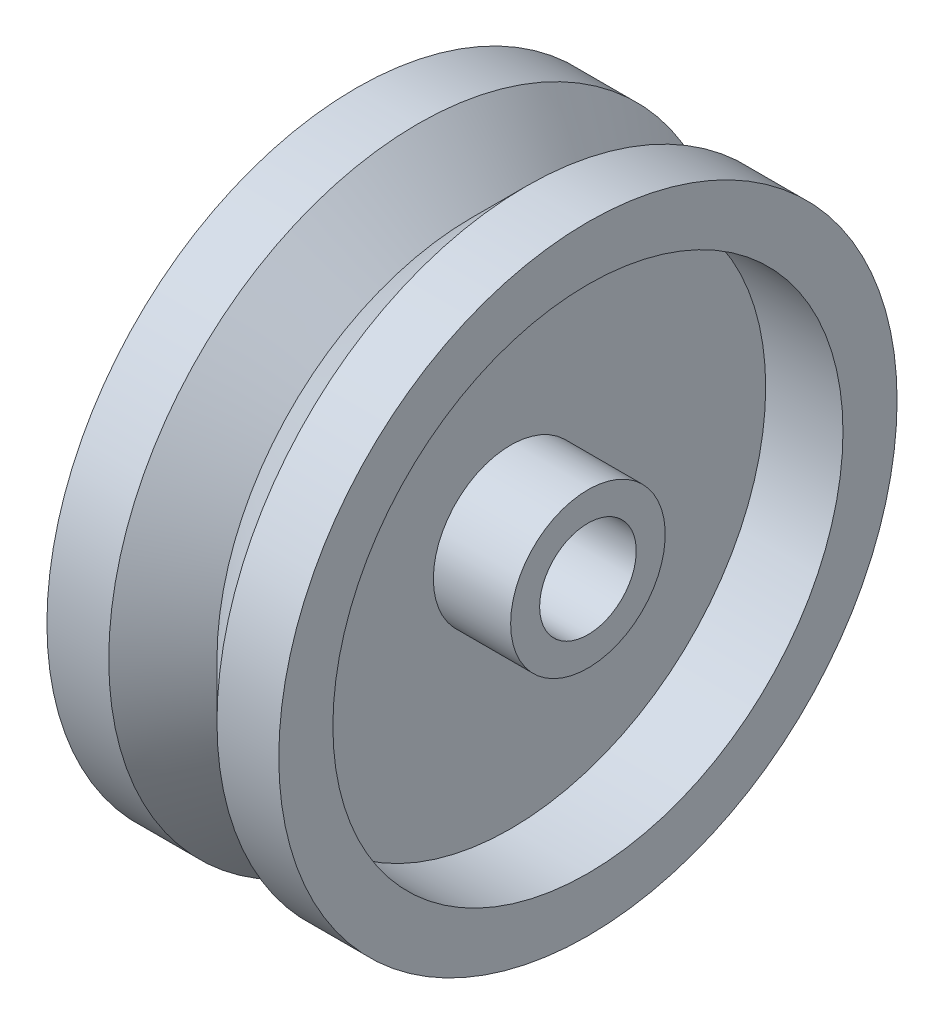
ISO-10303-21;
HEADER;
FILE_DESCRIPTION(('STEP AP214'),'2;1');
FILE_NAME('part.step','',(''),(''),'','','');
FILE_SCHEMA(('AUTOMOTIVE_DESIGN { 1 0 10303 214 1 1 1 1 }'));
ENDSEC;
DATA;
#1=APPLICATION_CONTEXT('core data for automotive mechanical design processes');
#2=APPLICATION_PROTOCOL_DEFINITION('international standard','automotive_design',2000,#1);
#3=PRODUCT_CONTEXT('',#1,'mechanical');
#4=PRODUCT('Part','Part','',(#3));
#5=PRODUCT_RELATED_PRODUCT_CATEGORY('part','',(#4));
#6=PRODUCT_DEFINITION_FORMATION('','',#4);
#7=PRODUCT_DEFINITION_CONTEXT('part definition',#1,'design');
#8=PRODUCT_DEFINITION('design','',#6,#7);
#9=PRODUCT_DEFINITION_SHAPE('','',#8);
#10=(LENGTH_UNIT() NAMED_UNIT(*) SI_UNIT(.MILLI.,.METRE.));
#11=(NAMED_UNIT(*) PLANE_ANGLE_UNIT() SI_UNIT($,.RADIAN.));
#12=(NAMED_UNIT(*) SI_UNIT($,.STERADIAN.) SOLID_ANGLE_UNIT());
#13=UNCERTAINTY_MEASURE_WITH_UNIT(LENGTH_MEASURE(1.E-05),#10,'distance_accuracy_value','');
#14=(GEOMETRIC_REPRESENTATION_CONTEXT(3) GLOBAL_UNCERTAINTY_ASSIGNED_CONTEXT((#13)) GLOBAL_UNIT_ASSIGNED_CONTEXT((#10,
#11,#12)) REPRESENTATION_CONTEXT('',''));
#15=CARTESIAN_POINT('',(0.,0.,0.));
#16=DIRECTION('',(0.,0.,1.));
#17=DIRECTION('',(1.,0.,0.));
#18=AXIS2_PLACEMENT_3D('',#15,#16,#17);
#19=CARTESIAN_POINT('',(-7.49999999999999,5.,0.));
#20=DIRECTION('',(1.,0.,0.));
#21=DIRECTION('',(0.,0.,-1.));
#22=AXIS2_PLACEMENT_3D('',#19,#20,#21);
#23=PLANE('',#22);
#24=CARTESIAN_POINT('',(-7.49999999999999,0.,0.));
#25=DIRECTION('',(-1.,0.,0.));
#26=DIRECTION('',(0.,0.,1.));
#27=AXIS2_PLACEMENT_3D('',#24,#25,#26);
#28=CIRCLE('',#27,3.125);
#29=CARTESIAN_POINT('',(-7.49999999999999,0.,3.125));
#30=VERTEX_POINT('',#29);
#31=EDGE_CURVE('E10',#30,#30,#28,.T.);
#32=ORIENTED_EDGE('',*,*,#31,.F.);
#33=EDGE_LOOP('',(#32));
#34=FACE_BOUND('',#33,.T.);
#35=CARTESIAN_POINT('',(-7.49999999999999,0.,0.));
#36=DIRECTION('',(-1.,0.,0.));
#37=DIRECTION('',(0.,0.,1.));
#38=AXIS2_PLACEMENT_3D('',#35,#36,#37);
#39=CIRCLE('',#38,5.);
#40=CARTESIAN_POINT('',(-7.49999999999999,0.,5.));
#41=VERTEX_POINT('',#40);
#42=EDGE_CURVE('E104',#41,#41,#39,.T.);
#43=ORIENTED_EDGE('',*,*,#42,.T.);
#44=EDGE_LOOP('',(#43));
#45=FACE_BOUND('',#44,.T.);
#46=ADVANCED_FACE('F41',(#34,#45),#23,.F.);
#47=CARTESIAN_POINT('',(-66.3692893219157,0.,0.));
#48=DIRECTION('',(-1.,0.,0.));
#49=DIRECTION('',(0.,0.,1.));
#50=AXIS2_PLACEMENT_3D('',#47,#48,#49);
#51=CYLINDRICAL_SURFACE('',#50,3.125);
#52=CARTESIAN_POINT('',(7.50000000000001,0.,0.));
#53=DIRECTION('',(-1.,0.,0.));
#54=DIRECTION('',(0.,0.,1.));
#55=AXIS2_PLACEMENT_3D('',#52,#53,#54);
#56=CIRCLE('',#55,3.125);
#57=CARTESIAN_POINT('',(7.50000000000001,0.,3.125));
#58=VERTEX_POINT('',#57);
#59=EDGE_CURVE('E48',#58,#58,#56,.T.);
#60=ORIENTED_EDGE('',*,*,#59,.F.);
#61=EDGE_LOOP('',(#60));
#62=FACE_BOUND('',#61,.T.);
#63=ORIENTED_EDGE('',*,*,#31,.T.);
#64=EDGE_LOOP('',(#63));
#65=FACE_BOUND('',#64,.T.);
#66=ADVANCED_FACE('F184',(#62,#65),#51,.F.);
#67=CARTESIAN_POINT('',(7.50000000000001,3.125,0.));
#68=DIRECTION('',(-1.,0.,0.));
#69=DIRECTION('',(0.,0.,1.));
#70=AXIS2_PLACEMENT_3D('',#67,#68,#69);
#71=PLANE('',#70);
#72=CARTESIAN_POINT('',(7.50000000000001,0.,0.));
#73=DIRECTION('',(-1.,0.,0.));
#74=DIRECTION('',(0.,0.,1.));
#75=AXIS2_PLACEMENT_3D('',#72,#73,#74);
#76=CIRCLE('',#75,5.);
#77=CARTESIAN_POINT('',(7.50000000000001,0.,5.));
#78=VERTEX_POINT('',#77);
#79=EDGE_CURVE('E55',#78,#78,#76,.T.);
#80=ORIENTED_EDGE('',*,*,#79,.F.);
#81=EDGE_LOOP('',(#80));
#82=FACE_BOUND('',#81,.T.);
#83=ORIENTED_EDGE('',*,*,#59,.T.);
#84=EDGE_LOOP('',(#83));
#85=FACE_BOUND('',#84,.T.);
#86=ADVANCED_FACE('F179',(#82,#85),#71,.F.);
#87=CARTESIAN_POINT('',(-66.3692893219157,0.,0.));
#88=DIRECTION('',(-1.,0.,0.));
#89=DIRECTION('',(0.,0.,1.));
#90=AXIS2_PLACEMENT_3D('',#87,#88,#89);
#91=CYLINDRICAL_SURFACE('',#90,5.);
#92=CARTESIAN_POINT('',(2.5,0.,0.));
#93=DIRECTION('',(-1.,0.,0.));
#94=DIRECTION('',(0.,0.,1.));
#95=AXIS2_PLACEMENT_3D('',#92,#93,#94);
#96=CIRCLE('',#95,5.);
#97=CARTESIAN_POINT('',(2.5,0.,5.));
#98=VERTEX_POINT('',#97);
#99=EDGE_CURVE('E61',#98,#98,#96,.T.);
#100=ORIENTED_EDGE('',*,*,#99,.F.);
#101=EDGE_LOOP('',(#100));
#102=FACE_BOUND('',#101,.T.);
#103=ORIENTED_EDGE('',*,*,#79,.T.);
#104=EDGE_LOOP('',(#103));
#105=FACE_BOUND('',#104,.T.);
#106=ADVANCED_FACE('F173',(#102,#105),#91,.T.);
#107=CARTESIAN_POINT('',(2.50000000000001,16.5,0.));
#108=DIRECTION('',(-1.,0.,0.));
#109=DIRECTION('',(0.,0.,1.));
#110=AXIS2_PLACEMENT_3D('',#107,#108,#109);
#111=PLANE('',#110);
#112=CARTESIAN_POINT('',(2.5,0.,0.));
#113=DIRECTION('',(-1.,0.,0.));
#114=DIRECTION('',(0.,0.,1.));
#115=AXIS2_PLACEMENT_3D('',#112,#113,#114);
#116=CIRCLE('',#115,16.5);
#117=CARTESIAN_POINT('',(2.5,0.,16.5));
#118=VERTEX_POINT('',#117);
#119=EDGE_CURVE('E67',#118,#118,#116,.T.);
#120=ORIENTED_EDGE('',*,*,#119,.F.);
#121=EDGE_LOOP('',(#120));
#122=FACE_BOUND('',#121,.T.);
#123=ORIENTED_EDGE('',*,*,#99,.T.);
#124=EDGE_LOOP('',(#123));
#125=FACE_BOUND('',#124,.T.);
#126=ADVANCED_FACE('F167',(#122,#125),#111,.F.);
#127=CARTESIAN_POINT('',(-66.3692893219157,0.,0.));
#128=DIRECTION('',(-1.,0.,0.));
#129=DIRECTION('',(0.,0.,1.));
#130=AXIS2_PLACEMENT_3D('',#127,#128,#129);
#131=CYLINDRICAL_SURFACE('',#130,16.5);
#132=CARTESIAN_POINT('',(7.50000000000001,0.,0.));
#133=DIRECTION('',(-1.,0.,0.));
#134=DIRECTION('',(0.,0.,1.));
#135=AXIS2_PLACEMENT_3D('',#132,#133,#134);
#136=CIRCLE('',#135,16.5);
#137=CARTESIAN_POINT('',(7.50000000000001,0.,16.5));
#138=VERTEX_POINT('',#137);
#139=EDGE_CURVE('E71',#138,#138,#136,.T.);
#140=ORIENTED_EDGE('',*,*,#139,.F.);
#141=EDGE_LOOP('',(#140));
#142=FACE_BOUND('',#141,.T.);
#143=ORIENTED_EDGE('',*,*,#119,.T.);
#144=EDGE_LOOP('',(#143));
#145=FACE_BOUND('',#144,.T.);
#146=ADVANCED_FACE('F161',(#142,#145),#131,.F.);
#147=CARTESIAN_POINT('',(7.50000000000001,16.5,0.));
#148=DIRECTION('',(-1.,0.,0.));
#149=DIRECTION('',(0.,0.,1.));
#150=AXIS2_PLACEMENT_3D('',#147,#148,#149);
#151=PLANE('',#150);
#152=CARTESIAN_POINT('',(7.50000000000001,0.,0.));
#153=DIRECTION('',(-1.,0.,0.));
#154=DIRECTION('',(0.,0.,1.));
#155=AXIS2_PLACEMENT_3D('',#152,#153,#154);
#156=CIRCLE('',#155,20.);
#157=CARTESIAN_POINT('',(7.50000000000001,0.,20.));
#158=VERTEX_POINT('',#157);
#159=EDGE_CURVE('E74',#158,#158,#156,.T.);
#160=ORIENTED_EDGE('',*,*,#159,.F.);
#161=EDGE_LOOP('',(#160));
#162=FACE_BOUND('',#161,.T.);
#163=ORIENTED_EDGE('',*,*,#139,.T.);
#164=EDGE_LOOP('',(#163));
#165=FACE_BOUND('',#164,.T.);
#166=ADVANCED_FACE('F155',(#162,#165),#151,.F.);
#167=CARTESIAN_POINT('',(-66.3692893219157,0.,0.));
#168=DIRECTION('',(-1.,0.,0.));
#169=DIRECTION('',(0.,0.,1.));
#170=AXIS2_PLACEMENT_3D('',#167,#168,#169);
#171=CYLINDRICAL_SURFACE('',#170,20.);
#172=CARTESIAN_POINT('',(3.5,0.,0.));
#173=DIRECTION('',(-1.,0.,0.));
#174=DIRECTION('',(0.,0.,1.));
#175=AXIS2_PLACEMENT_3D('',#172,#173,#174);
#176=CIRCLE('',#175,20.);
#177=CARTESIAN_POINT('',(3.5,0.,20.));
#178=VERTEX_POINT('',#177);
#179=EDGE_CURVE('E78',#178,#178,#176,.T.);
#180=ORIENTED_EDGE('',*,*,#179,.F.);
#181=EDGE_LOOP('',(#180));
#182=FACE_BOUND('',#181,.T.);
#183=ORIENTED_EDGE('',*,*,#159,.T.);
#184=EDGE_LOOP('',(#183));
#185=FACE_BOUND('',#184,.T.);
#186=ADVANCED_FACE('F149',(#182,#185),#171,.T.);
#187=CARTESIAN_POINT('',(3.5,0.,0.));
#188=DIRECTION('',(1.,0.,0.));
#189=DIRECTION('',(0.,0.,-1.));
#190=AXIS2_PLACEMENT_3D('',#187,#188,#189);
#191=CONICAL_SURFACE('',#190,20.,0.785398163397449);
#192=CARTESIAN_POINT('',(0.,0.,0.));
#193=DIRECTION('',(-1.,0.,0.));
#194=DIRECTION('',(0.,0.,1.));
#195=AXIS2_PLACEMENT_3D('',#192,#193,#194);
#196=CIRCLE('',#195,16.5);
#197=CARTESIAN_POINT('',(0.,0.,16.5));
#198=VERTEX_POINT('',#197);
#199=EDGE_CURVE('E82',#198,#198,#196,.T.);
#200=ORIENTED_EDGE('',*,*,#199,.F.);
#201=EDGE_LOOP('',(#200));
#202=FACE_BOUND('',#201,.T.);
#203=ORIENTED_EDGE('',*,*,#179,.T.);
#204=EDGE_LOOP('',(#203));
#205=FACE_BOUND('',#204,.T.);
#206=ADVANCED_FACE('F143',(#202,#205),#191,.T.);
#207=CARTESIAN_POINT('',(0.,0.,0.));
#208=DIRECTION('',(-1.,0.,0.));
#209=DIRECTION('',(0.,0.,1.));
#210=AXIS2_PLACEMENT_3D('',#207,#208,#209);
#211=CONICAL_SURFACE('',#210,16.5,0.785398163397451);
#212=CARTESIAN_POINT('',(-3.49999999999999,0.,0.));
#213=DIRECTION('',(-1.,0.,0.));
#214=DIRECTION('',(0.,0.,1.));
#215=AXIS2_PLACEMENT_3D('',#212,#213,#214);
#216=CIRCLE('',#215,20.);
#217=CARTESIAN_POINT('',(-3.49999999999999,0.,20.));
#218=VERTEX_POINT('',#217);
#219=EDGE_CURVE('E86',#218,#218,#216,.T.);
#220=ORIENTED_EDGE('',*,*,#219,.F.);
#221=EDGE_LOOP('',(#220));
#222=FACE_BOUND('',#221,.T.);
#223=ORIENTED_EDGE('',*,*,#199,.T.);
#224=EDGE_LOOP('',(#223));
#225=FACE_BOUND('',#224,.T.);
#226=ADVANCED_FACE('F137',(#222,#225),#211,.T.);
#227=CARTESIAN_POINT('',(-66.3692893219157,0.,0.));
#228=DIRECTION('',(-1.,0.,0.));
#229=DIRECTION('',(0.,0.,1.));
#230=AXIS2_PLACEMENT_3D('',#227,#228,#229);
#231=CYLINDRICAL_SURFACE('',#230,20.);
#232=CARTESIAN_POINT('',(-7.49999999999999,0.,0.));
#233=DIRECTION('',(-1.,0.,0.));
#234=DIRECTION('',(0.,0.,1.));
#235=AXIS2_PLACEMENT_3D('',#232,#233,#234);
#236=CIRCLE('',#235,20.);
#237=CARTESIAN_POINT('',(-7.49999999999999,0.,20.));
#238=VERTEX_POINT('',#237);
#239=EDGE_CURVE('E89',#238,#238,#236,.T.);
#240=ORIENTED_EDGE('',*,*,#239,.F.);
#241=EDGE_LOOP('',(#240));
#242=FACE_BOUND('',#241,.T.);
#243=ORIENTED_EDGE('',*,*,#219,.T.);
#244=EDGE_LOOP('',(#243));
#245=FACE_BOUND('',#244,.T.);
#246=ADVANCED_FACE('F131',(#242,#245),#231,.T.);
#247=CARTESIAN_POINT('',(-7.49999999999999,20.,0.));
#248=DIRECTION('',(1.,0.,0.));
#249=DIRECTION('',(0.,0.,-1.));
#250=AXIS2_PLACEMENT_3D('',#247,#248,#249);
#251=PLANE('',#250);
#252=CARTESIAN_POINT('',(-7.49999999999999,0.,0.));
#253=DIRECTION('',(-1.,0.,0.));
#254=DIRECTION('',(0.,0.,1.));
#255=AXIS2_PLACEMENT_3D('',#252,#253,#254);
#256=CIRCLE('',#255,16.5);
#257=CARTESIAN_POINT('',(-7.49999999999999,0.,16.5));
#258=VERTEX_POINT('',#257);
#259=EDGE_CURVE('E93',#258,#258,#256,.T.);
#260=ORIENTED_EDGE('',*,*,#259,.F.);
#261=EDGE_LOOP('',(#260));
#262=FACE_BOUND('',#261,.T.);
#263=ORIENTED_EDGE('',*,*,#239,.T.);
#264=EDGE_LOOP('',(#263));
#265=FACE_BOUND('',#264,.T.);
#266=ADVANCED_FACE('F125',(#262,#265),#251,.F.);
#267=CARTESIAN_POINT('',(-66.3692893219157,0.,0.));
#268=DIRECTION('',(-1.,0.,0.));
#269=DIRECTION('',(0.,0.,1.));
#270=AXIS2_PLACEMENT_3D('',#267,#268,#269);
#271=CYLINDRICAL_SURFACE('',#270,16.5);
#272=CARTESIAN_POINT('',(-2.49999999999999,0.,0.));
#273=DIRECTION('',(-1.,0.,0.));
#274=DIRECTION('',(0.,0.,1.));
#275=AXIS2_PLACEMENT_3D('',#272,#273,#274);
#276=CIRCLE('',#275,16.5);
#277=CARTESIAN_POINT('',(-2.49999999999999,0.,16.5));
#278=VERTEX_POINT('',#277);
#279=EDGE_CURVE('E96',#278,#278,#276,.T.);
#280=ORIENTED_EDGE('',*,*,#279,.F.);
#281=EDGE_LOOP('',(#280));
#282=FACE_BOUND('',#281,.T.);
#283=ORIENTED_EDGE('',*,*,#259,.T.);
#284=EDGE_LOOP('',(#283));
#285=FACE_BOUND('',#284,.T.);
#286=ADVANCED_FACE('F119',(#282,#285),#271,.F.);
#287=CARTESIAN_POINT('',(-2.49999999999999,16.5,0.));
#288=DIRECTION('',(1.,0.,0.));
#289=DIRECTION('',(0.,0.,-1.));
#290=AXIS2_PLACEMENT_3D('',#287,#288,#289);
#291=PLANE('',#290);
#292=CARTESIAN_POINT('',(-2.49999999999999,0.,0.));
#293=DIRECTION('',(-1.,0.,0.));
#294=DIRECTION('',(0.,0.,1.));
#295=AXIS2_PLACEMENT_3D('',#292,#293,#294);
#296=CIRCLE('',#295,5.);
#297=CARTESIAN_POINT('',(-2.49999999999999,0.,5.));
#298=VERTEX_POINT('',#297);
#299=EDGE_CURVE('E100',#298,#298,#296,.T.);
#300=ORIENTED_EDGE('',*,*,#299,.F.);
#301=EDGE_LOOP('',(#300));
#302=FACE_BOUND('',#301,.T.);
#303=ORIENTED_EDGE('',*,*,#279,.T.);
#304=EDGE_LOOP('',(#303));
#305=FACE_BOUND('',#304,.T.);
#306=ADVANCED_FACE('F113',(#302,#305),#291,.F.);
#307=CARTESIAN_POINT('',(-66.3692893219157,0.,0.));
#308=DIRECTION('',(-1.,0.,0.));
#309=DIRECTION('',(0.,0.,1.));
#310=AXIS2_PLACEMENT_3D('',#307,#308,#309);
#311=CYLINDRICAL_SURFACE('',#310,5.);
#312=ORIENTED_EDGE('',*,*,#42,.F.);
#313=EDGE_LOOP('',(#312));
#314=FACE_BOUND('',#313,.T.);
#315=ORIENTED_EDGE('',*,*,#299,.T.);
#316=EDGE_LOOP('',(#315));
#317=FACE_BOUND('',#316,.T.);
#318=ADVANCED_FACE('F110',(#314,#317),#311,.T.);
#319=CLOSED_SHELL('',(#46,#66,#86,#106,#126,#146,#166,#186,#206,#226,#246,#266,#286,#306,#318));
#320=MANIFOLD_SOLID_BREP('B2',#319);
#321=ADVANCED_BREP_SHAPE_REPRESENTATION('',(#18,#320),#14);
#322=SHAPE_DEFINITION_REPRESENTATION(#9,#321);
ENDSEC;
END-ISO-10303-21;
